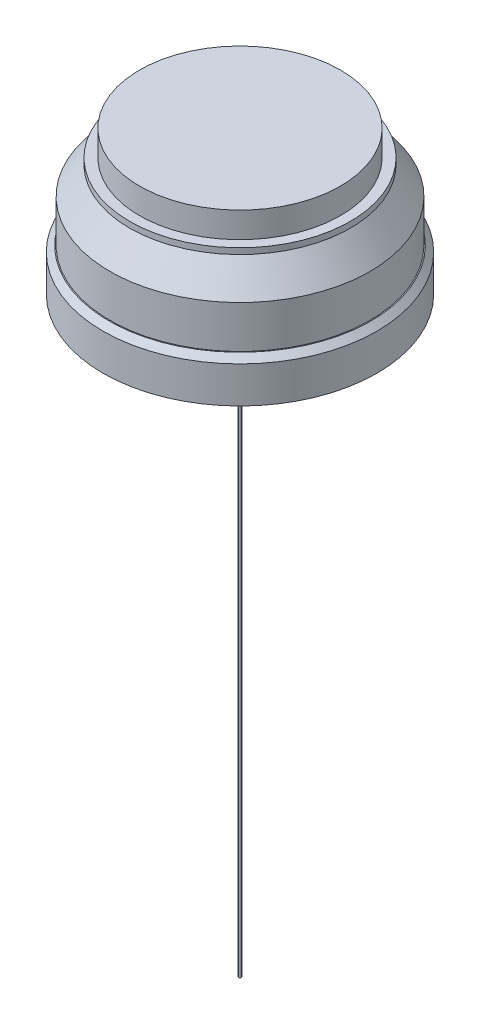
ISO-10303-21;
HEADER;
FILE_DESCRIPTION(('STEP AP214'),'2;1');
FILE_NAME('part.step','',(''),(''),'','','');
FILE_SCHEMA(('AUTOMOTIVE_DESIGN { 1 0 10303 214 1 1 1 1 }'));
ENDSEC;
DATA;
#1=APPLICATION_CONTEXT('core data for automotive mechanical design processes');
#2=APPLICATION_PROTOCOL_DEFINITION('international standard','automotive_design',2000,#1);
#3=PRODUCT_CONTEXT('',#1,'mechanical');
#4=PRODUCT('Part','Part','',(#3));
#5=PRODUCT_RELATED_PRODUCT_CATEGORY('part','',(#4));
#6=PRODUCT_DEFINITION_FORMATION('','',#4);
#7=PRODUCT_DEFINITION_CONTEXT('part definition',#1,'design');
#8=PRODUCT_DEFINITION('design','',#6,#7);
#9=PRODUCT_DEFINITION_SHAPE('','',#8);
#10=(LENGTH_UNIT() NAMED_UNIT(*) SI_UNIT(.MILLI.,.METRE.));
#11=(NAMED_UNIT(*) PLANE_ANGLE_UNIT() SI_UNIT($,.RADIAN.));
#12=(NAMED_UNIT(*) SI_UNIT($,.STERADIAN.) SOLID_ANGLE_UNIT());
#13=UNCERTAINTY_MEASURE_WITH_UNIT(LENGTH_MEASURE(1.E-05),#10,'distance_accuracy_value','');
#14=(GEOMETRIC_REPRESENTATION_CONTEXT(3) GLOBAL_UNCERTAINTY_ASSIGNED_CONTEXT((#13)) GLOBAL_UNIT_ASSIGNED_CONTEXT((#10,
#11,#12)) REPRESENTATION_CONTEXT('',''));
#15=CARTESIAN_POINT('',(0.,0.,0.));
#16=DIRECTION('',(0.,0.,1.));
#17=DIRECTION('',(1.,0.,0.));
#18=AXIS2_PLACEMENT_3D('',#15,#16,#17);
#19=CARTESIAN_POINT('',(0.,-73.,0.));
#20=DIRECTION('',(0.,-1.,0.));
#21=DIRECTION('',(0.,0.,-1.));
#22=AXIS2_PLACEMENT_3D('',#19,#20,#21);
#23=PLANE('',#22);
#24=CARTESIAN_POINT('',(0.,-73.,0.));
#25=DIRECTION('',(0.,-1.,0.));
#26=DIRECTION('',(0.,0.,-1.));
#27=AXIS2_PLACEMENT_3D('',#24,#25,#26);
#28=CIRCLE('',#27,69.5);
#29=CARTESIAN_POINT('',(0.,-73.,-69.5));
#30=VERTEX_POINT('',#29);
#31=EDGE_CURVE('E10',#30,#30,#28,.T.);
#32=ORIENTED_EDGE('',*,*,#31,.T.);
#33=EDGE_LOOP('',(#32));
#34=FACE_BOUND('',#33,.T.);
#35=CARTESIAN_POINT('',(0.,-73.,0.));
#36=DIRECTION('',(0.,-1.,0.));
#37=DIRECTION('',(0.,0.,-1.));
#38=AXIS2_PLACEMENT_3D('',#35,#36,#37);
#39=CIRCLE('',#38,0.643438367180292);
#40=CARTESIAN_POINT('',(0.,-73.,-0.643438367180292));
#41=VERTEX_POINT('',#40);
#42=EDGE_CURVE('E70',#41,#41,#39,.T.);
#43=ORIENTED_EDGE('',*,*,#42,.F.);
#44=EDGE_LOOP('',(#43));
#45=FACE_BOUND('',#44,.T.);
#46=ADVANCED_FACE('F34',(#34,#45),#23,.T.);
#47=CARTESIAN_POINT('',(0.,0.,0.));
#48=DIRECTION('',(0.,-1.,0.));
#49=DIRECTION('',(0.,0.,-1.));
#50=AXIS2_PLACEMENT_3D('',#47,#48,#49);
#51=PLANE('',#50);
#52=CARTESIAN_POINT('',(0.,0.,0.));
#53=DIRECTION('',(0.,-1.,0.));
#54=DIRECTION('',(0.,0.,-1.));
#55=AXIS2_PLACEMENT_3D('',#52,#53,#54);
#56=CIRCLE('',#55,51.);
#57=CARTESIAN_POINT('',(0.,0.,-51.));
#58=VERTEX_POINT('',#57);
#59=EDGE_CURVE('E38',#58,#58,#56,.T.);
#60=ORIENTED_EDGE('',*,*,#59,.F.);
#61=EDGE_LOOP('',(#60));
#62=FACE_BOUND('',#61,.T.);
#63=ADVANCED_FACE('F36',(#62),#51,.F.);
#64=CARTESIAN_POINT('',(0.,3.65,0.));
#65=DIRECTION('',(0.,-1.,0.));
#66=DIRECTION('',(0.,0.,-1.));
#67=AXIS2_PLACEMENT_3D('',#64,#65,#66);
#68=CYLINDRICAL_SURFACE('',#67,51.);
#69=CARTESIAN_POINT('',(0.,-13.,0.));
#70=DIRECTION('',(0.,-1.,0.));
#71=DIRECTION('',(0.,0.,-1.));
#72=AXIS2_PLACEMENT_3D('',#69,#70,#71);
#73=CIRCLE('',#72,51.);
#74=CARTESIAN_POINT('',(0.,-13.,-51.));
#75=VERTEX_POINT('',#74);
#76=EDGE_CURVE('E61',#75,#75,#73,.F.);
#77=ORIENTED_EDGE('',*,*,#76,.T.);
#78=EDGE_LOOP('',(#77));
#79=FACE_BOUND('',#78,.T.);
#80=ORIENTED_EDGE('',*,*,#59,.T.);
#81=EDGE_LOOP('',(#80));
#82=FACE_BOUND('',#81,.T.);
#83=ADVANCED_FACE('F96',(#79,#82),#68,.T.);
#84=CARTESIAN_POINT('',(0.,-13.,0.));
#85=DIRECTION('',(0.,-1.,0.));
#86=DIRECTION('',(0.,0.,-1.));
#87=AXIS2_PLACEMENT_3D('',#84,#85,#86);
#88=PLANE('',#87);
#89=ORIENTED_EDGE('',*,*,#76,.F.);
#90=EDGE_LOOP('',(#89));
#91=FACE_BOUND('',#90,.T.);
#92=CARTESIAN_POINT('',(0.,-13.,0.));
#93=DIRECTION('',(0.,-1.,0.));
#94=DIRECTION('',(0.,0.,-1.));
#95=AXIS2_PLACEMENT_3D('',#92,#93,#94);
#96=CIRCLE('',#95,56.);
#97=CARTESIAN_POINT('',(0.,-13.,-56.));
#98=VERTEX_POINT('',#97);
#99=EDGE_CURVE('E59',#98,#98,#96,.T.);
#100=ORIENTED_EDGE('',*,*,#99,.F.);
#101=EDGE_LOOP('',(#100));
#102=FACE_BOUND('',#101,.T.);
#103=ADVANCED_FACE('F86',(#91,#102),#88,.F.);
#104=CARTESIAN_POINT('',(0.,3.65,0.));
#105=DIRECTION('',(0.,-1.,0.));
#106=DIRECTION('',(0.,0.,-1.));
#107=AXIS2_PLACEMENT_3D('',#104,#105,#106);
#108=CYLINDRICAL_SURFACE('',#107,56.);
#109=ORIENTED_EDGE('',*,*,#99,.T.);
#110=EDGE_LOOP('',(#109));
#111=FACE_BOUND('',#110,.T.);
#112=CARTESIAN_POINT('',(0.,-15.9999999999977,0.));
#113=DIRECTION('',(0.,-1.,0.));
#114=DIRECTION('',(0.,0.,-1.));
#115=AXIS2_PLACEMENT_3D('',#112,#113,#114);
#116=CIRCLE('',#115,56.0000000000032);
#117=CARTESIAN_POINT('',(0.,-15.9999999999977,-56.0000000000032));
#118=VERTEX_POINT('',#117);
#119=EDGE_CURVE('E51',#118,#118,#116,.T.);
#120=ORIENTED_EDGE('',*,*,#119,.F.);
#121=EDGE_LOOP('',(#120));
#122=FACE_BOUND('',#121,.T.);
#123=ADVANCED_FACE('F84',(#111,#122),#108,.T.);
#124=CARTESIAN_POINT('',(0.,-29.9999999999996,0.));
#125=DIRECTION('',(0.,-1.,0.));
#126=DIRECTION('',(1.,0.,0.));
#127=AXIS2_PLACEMENT_3D('',#124,#125,#126);
#128=CONICAL_SURFACE('',#127,66.0000000000005,0.620249485982628);
#129=CARTESIAN_POINT('',(0.,-30.,0.));
#130=DIRECTION('',(0.,-1.,0.));
#131=DIRECTION('',(0.,0.,-1.));
#132=AXIS2_PLACEMENT_3D('',#129,#130,#131);
#133=CIRCLE('',#132,66.);
#134=CARTESIAN_POINT('',(0.,-30.,-66.));
#135=VERTEX_POINT('',#134);
#136=EDGE_CURVE('E58',#135,#135,#133,.T.);
#137=ORIENTED_EDGE('',*,*,#136,.F.);
#138=EDGE_LOOP('',(#137));
#139=FACE_BOUND('',#138,.T.);
#140=ORIENTED_EDGE('',*,*,#119,.T.);
#141=EDGE_LOOP('',(#140));
#142=FACE_BOUND('',#141,.T.);
#143=ADVANCED_FACE('F82',(#139,#142),#128,.T.);
#144=CARTESIAN_POINT('',(0.,3.65,0.));
#145=DIRECTION('',(0.,-1.,0.));
#146=DIRECTION('',(0.,0.,-1.));
#147=AXIS2_PLACEMENT_3D('',#144,#145,#146);
#148=CYLINDRICAL_SURFACE('',#147,66.);
#149=CARTESIAN_POINT('',(0.,-51.5,0.));
#150=DIRECTION('',(0.,-1.,0.));
#151=DIRECTION('',(0.,0.,-1.));
#152=AXIS2_PLACEMENT_3D('',#149,#150,#151);
#153=CIRCLE('',#152,66.);
#154=CARTESIAN_POINT('',(0.,-51.5,-66.));
#155=VERTEX_POINT('',#154);
#156=EDGE_CURVE('E55',#155,#155,#153,.F.);
#157=ORIENTED_EDGE('',*,*,#156,.T.);
#158=EDGE_LOOP('',(#157));
#159=FACE_BOUND('',#158,.T.);
#160=ORIENTED_EDGE('',*,*,#136,.T.);
#161=EDGE_LOOP('',(#160));
#162=FACE_BOUND('',#161,.T.);
#163=ADVANCED_FACE('F93',(#159,#162),#148,.T.);
#164=CARTESIAN_POINT('',(0.,-51.5,0.));
#165=DIRECTION('',(0.,-1.,0.));
#166=DIRECTION('',(0.,0.,-1.));
#167=AXIS2_PLACEMENT_3D('',#164,#165,#166);
#168=PLANE('',#167);
#169=ORIENTED_EDGE('',*,*,#156,.F.);
#170=EDGE_LOOP('',(#169));
#171=FACE_BOUND('',#170,.T.);
#172=CARTESIAN_POINT('',(0.,-51.4999999999998,0.));
#173=DIRECTION('',(0.,-1.,0.));
#174=DIRECTION('',(0.,0.,-1.));
#175=AXIS2_PLACEMENT_3D('',#172,#173,#174);
#176=CIRCLE('',#175,66.5000000000002);
#177=CARTESIAN_POINT('',(0.,-51.4999999999998,-66.5000000000002));
#178=VERTEX_POINT('',#177);
#179=EDGE_CURVE('E47',#178,#178,#176,.T.);
#180=ORIENTED_EDGE('',*,*,#179,.F.);
#181=EDGE_LOOP('',(#180));
#182=FACE_BOUND('',#181,.T.);
#183=ADVANCED_FACE('F119',(#171,#182),#168,.F.);
#184=CARTESIAN_POINT('',(0.,-54.5000000000002,0.));
#185=DIRECTION('',(0.,-1.,0.));
#186=DIRECTION('',(0.,0.,-1.));
#187=AXIS2_PLACEMENT_3D('',#184,#185,#186);
#188=CONICAL_SURFACE('',#187,69.4999999999998,0.7853981633973);
#189=CARTESIAN_POINT('',(0.,-54.5,0.));
#190=DIRECTION('',(0.,-1.,0.));
#191=DIRECTION('',(0.,0.,-1.));
#192=AXIS2_PLACEMENT_3D('',#189,#190,#191);
#193=CIRCLE('',#192,69.5);
#194=CARTESIAN_POINT('',(0.,-54.5,-69.5));
#195=VERTEX_POINT('',#194);
#196=EDGE_CURVE('E42',#195,#195,#193,.T.);
#197=ORIENTED_EDGE('',*,*,#196,.F.);
#198=EDGE_LOOP('',(#197));
#199=FACE_BOUND('',#198,.T.);
#200=ORIENTED_EDGE('',*,*,#179,.T.);
#201=EDGE_LOOP('',(#200));
#202=FACE_BOUND('',#201,.T.);
#203=ADVANCED_FACE('F111',(#199,#202),#188,.T.);
#204=CARTESIAN_POINT('',(0.,3.65,0.));
#205=DIRECTION('',(0.,-1.,0.));
#206=DIRECTION('',(0.,0.,-1.));
#207=AXIS2_PLACEMENT_3D('',#204,#205,#206);
#208=CYLINDRICAL_SURFACE('',#207,69.5);
#209=ORIENTED_EDGE('',*,*,#31,.F.);
#210=EDGE_LOOP('',(#209));
#211=FACE_BOUND('',#210,.T.);
#212=ORIENTED_EDGE('',*,*,#196,.T.);
#213=EDGE_LOOP('',(#212));
#214=FACE_BOUND('',#213,.T.);
#215=ADVANCED_FACE('F101',(#211,#214),#208,.T.);
#216=CARTESIAN_POINT('',(0.,-373.,0.));
#217=DIRECTION('',(0.,1.,0.));
#218=DIRECTION('',(0.,0.,1.));
#219=AXIS2_PLACEMENT_3D('',#216,#217,#218);
#220=CYLINDRICAL_SURFACE('',#219,0.643438367180292);
#221=CARTESIAN_POINT('',(0.,-373.,0.));
#222=DIRECTION('',(0.,-1.,0.));
#223=DIRECTION('',(0.,0.,-1.));
#224=AXIS2_PLACEMENT_3D('',#221,#222,#223);
#225=CIRCLE('',#224,0.643438367180292);
#226=CARTESIAN_POINT('',(0.,-373.,-0.643438367180292));
#227=VERTEX_POINT('',#226);
#228=EDGE_CURVE('E66',#227,#227,#225,.T.);
#229=ORIENTED_EDGE('',*,*,#228,.F.);
#230=EDGE_LOOP('',(#229));
#231=FACE_BOUND('',#230,.T.);
#232=ORIENTED_EDGE('',*,*,#42,.T.);
#233=EDGE_LOOP('',(#232));
#234=FACE_BOUND('',#233,.T.);
#235=ADVANCED_FACE('F106',(#231,#234),#220,.T.);
#236=CARTESIAN_POINT('',(0.,-373.,0.));
#237=DIRECTION('',(0.,-1.,0.));
#238=DIRECTION('',(0.,0.,-1.));
#239=AXIS2_PLACEMENT_3D('',#236,#237,#238);
#240=PLANE('',#239);
#241=ORIENTED_EDGE('',*,*,#228,.T.);
#242=EDGE_LOOP('',(#241));
#243=FACE_BOUND('',#242,.T.);
#244=ADVANCED_FACE('F117',(#243),#240,.T.);
#245=CLOSED_SHELL('',(#46,#63,#83,#103,#123,#143,#163,#183,#203,#215,#235,#244));
#246=MANIFOLD_SOLID_BREP('B2',#245);
#247=ADVANCED_BREP_SHAPE_REPRESENTATION('',(#18,#246),#14);
#248=SHAPE_DEFINITION_REPRESENTATION(#9,#247);
ENDSEC;
END-ISO-10303-21;
